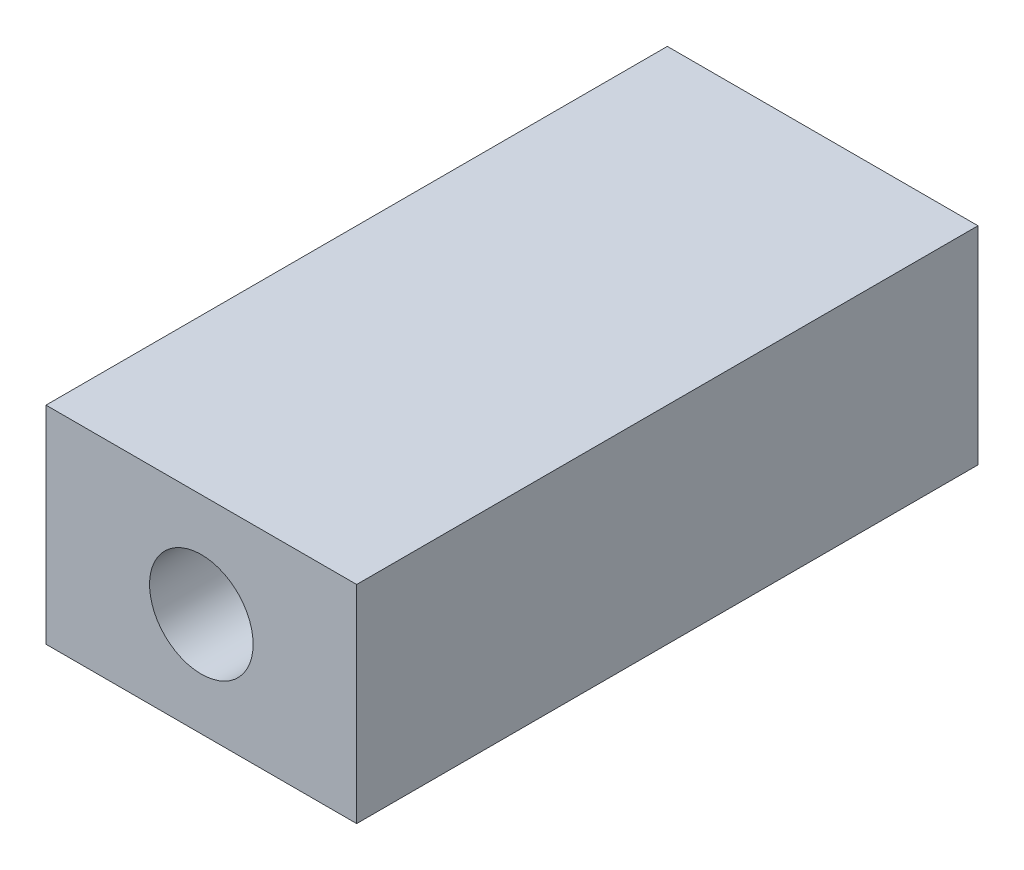
ISO-10303-21;
HEADER;
FILE_DESCRIPTION(('STEP AP214'),'2;1');
FILE_NAME('part.step','',(''),(''),'','','');
FILE_SCHEMA(('AUTOMOTIVE_DESIGN { 1 0 10303 214 1 1 1 1 }'));
ENDSEC;
DATA;
#1=APPLICATION_CONTEXT('core data for automotive mechanical design processes');
#2=APPLICATION_PROTOCOL_DEFINITION('international standard','automotive_design',2000,#1);
#3=PRODUCT_CONTEXT('',#1,'mechanical');
#4=PRODUCT('Part','Part','',(#3));
#5=PRODUCT_RELATED_PRODUCT_CATEGORY('part','',(#4));
#6=PRODUCT_DEFINITION_FORMATION('','',#4);
#7=PRODUCT_DEFINITION_CONTEXT('part definition',#1,'design');
#8=PRODUCT_DEFINITION('design','',#6,#7);
#9=PRODUCT_DEFINITION_SHAPE('','',#8);
#10=(LENGTH_UNIT() NAMED_UNIT(*) SI_UNIT(.MILLI.,.METRE.));
#11=(NAMED_UNIT(*) PLANE_ANGLE_UNIT() SI_UNIT($,.RADIAN.));
#12=(NAMED_UNIT(*) SI_UNIT($,.STERADIAN.) SOLID_ANGLE_UNIT());
#13=UNCERTAINTY_MEASURE_WITH_UNIT(LENGTH_MEASURE(1.E-05),#10,'distance_accuracy_value','');
#14=(GEOMETRIC_REPRESENTATION_CONTEXT(3) GLOBAL_UNCERTAINTY_ASSIGNED_CONTEXT((#13)) GLOBAL_UNIT_ASSIGNED_CONTEXT((#10,
#11,#12)) REPRESENTATION_CONTEXT('',''));
#15=CARTESIAN_POINT('',(0.,0.,0.));
#16=DIRECTION('',(0.,0.,1.));
#17=DIRECTION('',(1.,0.,0.));
#18=AXIS2_PLACEMENT_3D('',#15,#16,#17);
#19=CARTESIAN_POINT('',(0.349498461415498,-0.412280701754386,12.));
#20=DIRECTION('',(0.,0.,-1.));
#21=DIRECTION('',(-1.,0.,0.));
#22=AXIS2_PLACEMENT_3D('',#19,#20,#21);
#23=CYLINDRICAL_SURFACE('',#22,0.5);
#24=CARTESIAN_POINT('',(0.349498461415498,-0.412280701754386,0.));
#25=DIRECTION('',(0.,0.,1.));
#26=DIRECTION('',(1.,0.,0.));
#27=AXIS2_PLACEMENT_3D('',#24,#25,#26);
#28=CIRCLE('',#27,0.5);
#29=CARTESIAN_POINT('',(0.849498461415498,-0.412280701754386,0.));
#30=VERTEX_POINT('',#29);
#31=EDGE_CURVE('E101',#30,#30,#28,.T.);
#32=ORIENTED_EDGE('',*,*,#31,.F.);
#33=EDGE_LOOP('',(#32));
#34=FACE_BOUND('',#33,.T.);
#35=CARTESIAN_POINT('',(0.349498461415498,-0.412280701754386,6.));
#36=DIRECTION('',(0.,0.,1.));
#37=DIRECTION('',(1.,0.,0.));
#38=AXIS2_PLACEMENT_3D('',#35,#36,#37);
#39=CIRCLE('',#38,0.5);
#40=CARTESIAN_POINT('',(0.849498461415498,-0.412280701754386,6.));
#41=VERTEX_POINT('',#40);
#42=EDGE_CURVE('E36',#41,#41,#39,.T.);
#43=ORIENTED_EDGE('',*,*,#42,.T.);
#44=EDGE_LOOP('',(#43));
#45=FACE_BOUND('',#44,.T.);
#46=ADVANCED_FACE('F32',(#34,#45),#23,.F.);
#47=CARTESIAN_POINT('',(0.,0.,12.));
#48=DIRECTION('',(0.,0.,1.));
#49=DIRECTION('',(1.,0.,0.));
#50=AXIS2_PLACEMENT_3D('',#47,#48,#49);
#51=PLANE('',#50);
#52=CARTESIAN_POINT('',(0.349498461415498,-0.412280701754386,12.));
#53=DIRECTION('',(0.,0.,1.));
#54=DIRECTION('',(1.,0.,0.));
#55=AXIS2_PLACEMENT_3D('',#52,#53,#54);
#56=CIRCLE('',#55,1.);
#57=CARTESIAN_POINT('',(1.3494984614155,-0.412280701754386,12.));
#58=VERTEX_POINT('',#57);
#59=EDGE_CURVE('E115',#58,#58,#56,.T.);
#60=ORIENTED_EDGE('',*,*,#59,.F.);
#61=EDGE_LOOP('',(#60));
#62=FACE_BOUND('',#61,.T.);
#63=DIRECTION('',(0.,-1.,0.));
#64=VECTOR('',#63,1.);
#65=CARTESIAN_POINT('',(-2.6505015385845,1.58771929824561,12.));
#66=LINE('',#65,#64);
#67=CARTESIAN_POINT('',(-2.6505015385845,1.58771929824561,12.));
#68=VERTEX_POINT('',#67);
#69=CARTESIAN_POINT('',(-2.6505015385845,-2.41228070175439,12.));
#70=VERTEX_POINT('',#69);
#71=EDGE_CURVE('E85',#68,#70,#66,.T.);
#72=ORIENTED_EDGE('',*,*,#71,.T.);
#73=DIRECTION('',(1.,0.,0.));
#74=VECTOR('',#73,1.);
#75=CARTESIAN_POINT('',(-2.6505015385845,-2.41228070175439,12.));
#76=LINE('',#75,#74);
#77=CARTESIAN_POINT('',(3.3494984614155,-2.41228070175439,12.));
#78=VERTEX_POINT('',#77);
#79=EDGE_CURVE('E80',#70,#78,#76,.T.);
#80=ORIENTED_EDGE('',*,*,#79,.T.);
#81=DIRECTION('',(0.,1.,0.));
#82=VECTOR('',#81,1.);
#83=CARTESIAN_POINT('',(3.3494984614155,1.58771929824561,12.));
#84=LINE('',#83,#82);
#85=CARTESIAN_POINT('',(3.3494984614155,1.58771929824561,12.));
#86=VERTEX_POINT('',#85);
#87=EDGE_CURVE('E83',#78,#86,#84,.T.);
#88=ORIENTED_EDGE('',*,*,#87,.T.);
#89=DIRECTION('',(-1.,0.,0.));
#90=VECTOR('',#89,1.);
#91=CARTESIAN_POINT('',(-2.6505015385845,1.58771929824561,12.));
#92=LINE('',#91,#90);
#93=EDGE_CURVE('E50',#86,#68,#92,.T.);
#94=ORIENTED_EDGE('',*,*,#93,.T.);
#95=EDGE_LOOP('',(#72,#80,#88,#94));
#96=FACE_BOUND('',#95,.T.);
#97=ADVANCED_FACE('F81',(#62,#96),#51,.T.);
#98=CARTESIAN_POINT('',(0.,0.,0.));
#99=DIRECTION('',(0.,0.,1.));
#100=DIRECTION('',(1.,0.,0.));
#101=AXIS2_PLACEMENT_3D('',#98,#99,#100);
#102=PLANE('',#101);
#103=DIRECTION('',(0.,-1.,0.));
#104=VECTOR('',#103,1.);
#105=CARTESIAN_POINT('',(-2.6505015385845,1.58771929824561,0.));
#106=LINE('',#105,#104);
#107=CARTESIAN_POINT('',(-2.6505015385845,1.58771929824561,0.));
#108=VERTEX_POINT('',#107);
#109=CARTESIAN_POINT('',(-2.6505015385845,-2.41228070175439,0.));
#110=VERTEX_POINT('',#109);
#111=EDGE_CURVE('E98',#108,#110,#106,.T.);
#112=ORIENTED_EDGE('',*,*,#111,.F.);
#113=DIRECTION('',(-1.,0.,0.));
#114=VECTOR('',#113,1.);
#115=CARTESIAN_POINT('',(-2.6505015385845,1.58771929824561,0.));
#116=LINE('',#115,#114);
#117=CARTESIAN_POINT('',(3.3494984614155,1.58771929824561,0.));
#118=VERTEX_POINT('',#117);
#119=EDGE_CURVE('E73',#118,#108,#116,.T.);
#120=ORIENTED_EDGE('',*,*,#119,.F.);
#121=DIRECTION('',(0.,1.,0.));
#122=VECTOR('',#121,1.);
#123=CARTESIAN_POINT('',(3.3494984614155,1.58771929824561,0.));
#124=LINE('',#123,#122);
#125=CARTESIAN_POINT('',(3.3494984614155,-2.41228070175439,0.));
#126=VERTEX_POINT('',#125);
#127=EDGE_CURVE('E67',#126,#118,#124,.T.);
#128=ORIENTED_EDGE('',*,*,#127,.F.);
#129=DIRECTION('',(1.,0.,0.));
#130=VECTOR('',#129,1.);
#131=CARTESIAN_POINT('',(-2.6505015385845,-2.41228070175439,0.));
#132=LINE('',#131,#130);
#133=EDGE_CURVE('E89',#110,#126,#132,.T.);
#134=ORIENTED_EDGE('',*,*,#133,.F.);
#135=EDGE_LOOP('',(#112,#120,#128,#134));
#136=FACE_BOUND('',#135,.T.);
#137=ORIENTED_EDGE('',*,*,#31,.T.);
#138=EDGE_LOOP('',(#137));
#139=FACE_BOUND('',#138,.T.);
#140=ADVANCED_FACE('F109',(#136,#139),#102,.F.);
#141=CARTESIAN_POINT('',(-2.6505015385845,1.58771929824561,12.));
#142=DIRECTION('',(1.,0.,0.));
#143=DIRECTION('',(0.,0.,-1.));
#144=AXIS2_PLACEMENT_3D('',#141,#142,#143);
#145=PLANE('',#144);
#146=ORIENTED_EDGE('',*,*,#111,.T.);
#147=DIRECTION('',(0.,0.,-1.));
#148=VECTOR('',#147,1.);
#149=CARTESIAN_POINT('',(-2.6505015385845,-2.41228070175439,12.));
#150=LINE('',#149,#148);
#151=EDGE_CURVE('E11',#70,#110,#150,.T.);
#152=ORIENTED_EDGE('',*,*,#151,.F.);
#153=ORIENTED_EDGE('',*,*,#71,.F.);
#154=DIRECTION('',(0.,0.,-1.));
#155=VECTOR('',#154,1.);
#156=CARTESIAN_POINT('',(-2.6505015385845,1.58771929824561,12.));
#157=LINE('',#156,#155);
#158=EDGE_CURVE('E94',#68,#108,#157,.T.);
#159=ORIENTED_EDGE('',*,*,#158,.T.);
#160=EDGE_LOOP('',(#146,#152,#153,#159));
#161=FACE_BOUND('',#160,.T.);
#162=ADVANCED_FACE('F34',(#161),#145,.F.);
#163=CARTESIAN_POINT('',(-2.6505015385845,-2.41228070175439,12.));
#164=DIRECTION('',(0.,1.,0.));
#165=DIRECTION('',(0.,0.,1.));
#166=AXIS2_PLACEMENT_3D('',#163,#164,#165);
#167=PLANE('',#166);
#168=ORIENTED_EDGE('',*,*,#133,.T.);
#169=DIRECTION('',(0.,0.,-1.));
#170=VECTOR('',#169,1.);
#171=CARTESIAN_POINT('',(3.3494984614155,-2.41228070175439,12.));
#172=LINE('',#171,#170);
#173=EDGE_CURVE('E42',#78,#126,#172,.T.);
#174=ORIENTED_EDGE('',*,*,#173,.F.);
#175=ORIENTED_EDGE('',*,*,#79,.F.);
#176=ORIENTED_EDGE('',*,*,#151,.T.);
#177=EDGE_LOOP('',(#168,#174,#175,#176));
#178=FACE_BOUND('',#177,.T.);
#179=ADVANCED_FACE('F88',(#178),#167,.F.);
#180=CARTESIAN_POINT('',(3.3494984614155,1.58771929824561,12.));
#181=DIRECTION('',(-1.,0.,0.));
#182=DIRECTION('',(0.,-1.,0.));
#183=AXIS2_PLACEMENT_3D('',#180,#181,#182);
#184=PLANE('',#183);
#185=ORIENTED_EDGE('',*,*,#127,.T.);
#186=DIRECTION('',(0.,0.,-1.));
#187=VECTOR('',#186,1.);
#188=CARTESIAN_POINT('',(3.3494984614155,1.58771929824561,12.));
#189=LINE('',#188,#187);
#190=EDGE_CURVE('E90',#86,#118,#189,.T.);
#191=ORIENTED_EDGE('',*,*,#190,.F.);
#192=ORIENTED_EDGE('',*,*,#87,.F.);
#193=ORIENTED_EDGE('',*,*,#173,.T.);
#194=EDGE_LOOP('',(#185,#191,#192,#193));
#195=FACE_BOUND('',#194,.T.);
#196=ADVANCED_FACE('F92',(#195),#184,.F.);
#197=CARTESIAN_POINT('',(-2.6505015385845,1.58771929824561,12.));
#198=DIRECTION('',(0.,-1.,0.));
#199=DIRECTION('',(0.,0.,-1.));
#200=AXIS2_PLACEMENT_3D('',#197,#198,#199);
#201=PLANE('',#200);
#202=ORIENTED_EDGE('',*,*,#119,.T.);
#203=ORIENTED_EDGE('',*,*,#158,.F.);
#204=ORIENTED_EDGE('',*,*,#93,.F.);
#205=ORIENTED_EDGE('',*,*,#190,.T.);
#206=EDGE_LOOP('',(#202,#203,#204,#205));
#207=FACE_BOUND('',#206,.T.);
#208=ADVANCED_FACE('F106',(#207),#201,.F.);
#209=CARTESIAN_POINT('',(0.349498461415498,-0.412280701754386,6.));
#210=DIRECTION('',(0.,0.,1.));
#211=DIRECTION('',(1.,0.,0.));
#212=AXIS2_PLACEMENT_3D('',#209,#210,#211);
#213=CYLINDRICAL_SURFACE('',#212,1.);
#214=CARTESIAN_POINT('',(0.349498461415498,-0.412280701754386,6.));
#215=DIRECTION('',(0.,0.,1.));
#216=DIRECTION('',(1.,0.,0.));
#217=AXIS2_PLACEMENT_3D('',#214,#215,#216);
#218=CIRCLE('',#217,1.);
#219=CARTESIAN_POINT('',(1.3494984614155,-0.412280701754386,6.));
#220=VERTEX_POINT('',#219);
#221=EDGE_CURVE('E118',#220,#220,#218,.T.);
#222=ORIENTED_EDGE('',*,*,#221,.F.);
#223=EDGE_LOOP('',(#222));
#224=FACE_BOUND('',#223,.T.);
#225=ORIENTED_EDGE('',*,*,#59,.T.);
#226=EDGE_LOOP('',(#225));
#227=FACE_BOUND('',#226,.T.);
#228=ADVANCED_FACE('F128',(#224,#227),#213,.F.);
#229=CARTESIAN_POINT('',(0.349498461415498,-0.412280701754386,6.));
#230=DIRECTION('',(0.,0.,1.));
#231=DIRECTION('',(1.,0.,0.));
#232=AXIS2_PLACEMENT_3D('',#229,#230,#231);
#233=PLANE('',#232);
#234=ORIENTED_EDGE('',*,*,#42,.F.);
#235=EDGE_LOOP('',(#234));
#236=FACE_BOUND('',#235,.T.);
#237=ORIENTED_EDGE('',*,*,#221,.T.);
#238=EDGE_LOOP('',(#237));
#239=FACE_BOUND('',#238,.T.);
#240=ADVANCED_FACE('F126',(#236,#239),#233,.T.);
#241=CLOSED_SHELL('',(#46,#97,#140,#162,#179,#196,#208,#228,#240));
#242=MANIFOLD_SOLID_BREP('B2',#241);
#243=ADVANCED_BREP_SHAPE_REPRESENTATION('',(#18,#242),#14);
#244=SHAPE_DEFINITION_REPRESENTATION(#9,#243);
ENDSEC;
END-ISO-10303-21;
